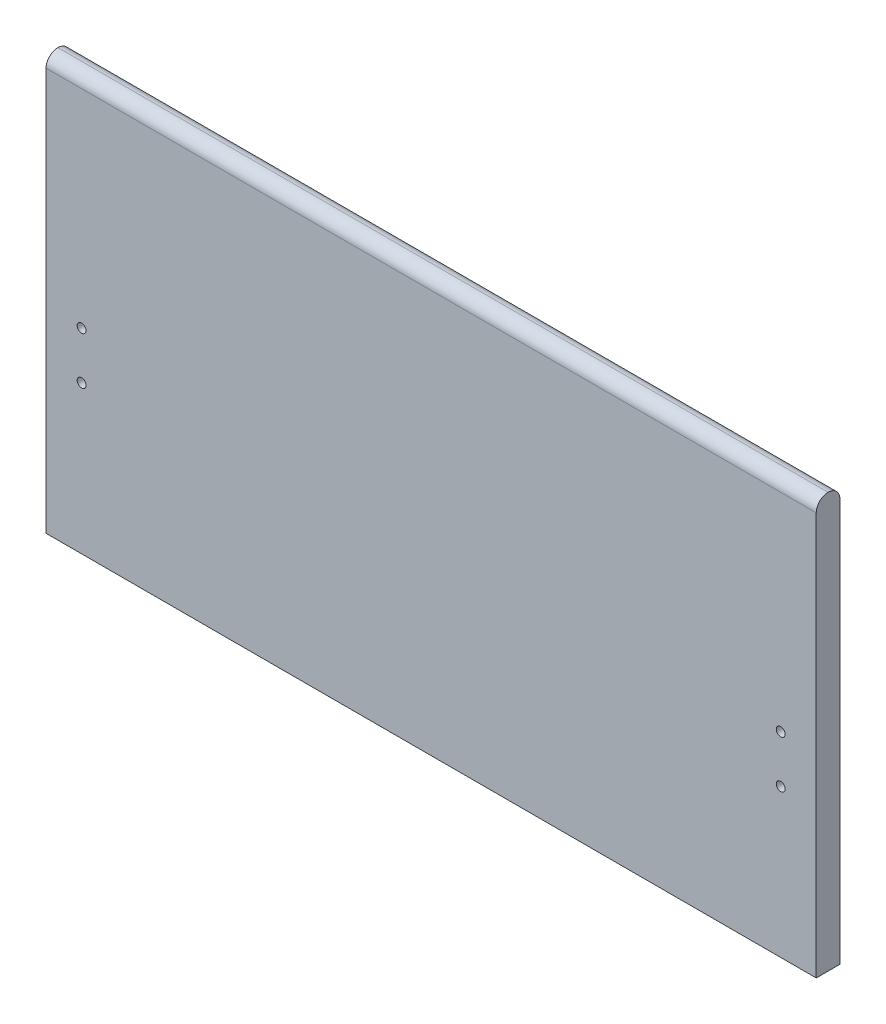
ISO-10303-21;
HEADER;
FILE_DESCRIPTION(('STEP AP214'),'2;1');
FILE_NAME('part.step','',(''),(''),'','','');
FILE_SCHEMA(('AUTOMOTIVE_DESIGN { 1 0 10303 214 1 1 1 1 }'));
ENDSEC;
DATA;
#1=APPLICATION_CONTEXT('core data for automotive mechanical design processes');
#2=APPLICATION_PROTOCOL_DEFINITION('international standard','automotive_design',2000,#1);
#3=PRODUCT_CONTEXT('',#1,'mechanical');
#4=PRODUCT('Part','Part','',(#3));
#5=PRODUCT_RELATED_PRODUCT_CATEGORY('part','',(#4));
#6=PRODUCT_DEFINITION_FORMATION('','',#4);
#7=PRODUCT_DEFINITION_CONTEXT('part definition',#1,'design');
#8=PRODUCT_DEFINITION('design','',#6,#7);
#9=PRODUCT_DEFINITION_SHAPE('','',#8);
#10=(LENGTH_UNIT() NAMED_UNIT(*) SI_UNIT(.MILLI.,.METRE.));
#11=(NAMED_UNIT(*) PLANE_ANGLE_UNIT() SI_UNIT($,.RADIAN.));
#12=(NAMED_UNIT(*) SI_UNIT($,.STERADIAN.) SOLID_ANGLE_UNIT());
#13=UNCERTAINTY_MEASURE_WITH_UNIT(LENGTH_MEASURE(1.E-05),#10,'distance_accuracy_value','');
#14=(GEOMETRIC_REPRESENTATION_CONTEXT(3) GLOBAL_UNCERTAINTY_ASSIGNED_CONTEXT((#13)) GLOBAL_UNIT_ASSIGNED_CONTEXT((#10,
#11,#12)) REPRESENTATION_CONTEXT('',''));
#15=CARTESIAN_POINT('',(0.,0.,0.));
#16=DIRECTION('',(0.,0.,1.));
#17=DIRECTION('',(1.,0.,0.));
#18=AXIS2_PLACEMENT_3D('',#15,#16,#17);
#19=CARTESIAN_POINT('',(0.,0.,40.));
#20=DIRECTION('',(1.,0.,0.));
#21=DIRECTION('',(0.,1.,0.));
#22=AXIS2_PLACEMENT_3D('',#19,#20,#21);
#23=PLANE('',#22);
#24=CARTESIAN_POINT('',(0.,-20.,20.));
#25=DIRECTION('',(1.,0.,0.));
#26=DIRECTION('',(0.,1.,0.));
#27=AXIS2_PLACEMENT_3D('',#24,#25,#26);
#28=CIRCLE('',#27,20.);
#29=CARTESIAN_POINT('',(0.,-20.,40.));
#30=VERTEX_POINT('',#29);
#31=CARTESIAN_POINT('',(0.,0.,20.));
#32=VERTEX_POINT('',#31);
#33=EDGE_CURVE('E99',#30,#32,#28,.F.);
#34=ORIENTED_EDGE('',*,*,#33,.T.);
#35=CARTESIAN_POINT('',(0.,-20.,20.));
#36=DIRECTION('',(1.,0.,0.));
#37=DIRECTION('',(0.,1.,0.));
#38=AXIS2_PLACEMENT_3D('',#35,#36,#37);
#39=CIRCLE('',#38,20.);
#40=CARTESIAN_POINT('',(0.,-20.,0.));
#41=VERTEX_POINT('',#40);
#42=EDGE_CURVE('E101',#32,#41,#39,.F.);
#43=ORIENTED_EDGE('',*,*,#42,.T.);
#44=DIRECTION('',(0.,-1.,0.));
#45=VECTOR('',#44,1.);
#46=CARTESIAN_POINT('',(0.,0.,0.));
#47=LINE('',#46,#45);
#48=CARTESIAN_POINT('',(0.,-700.,0.));
#49=VERTEX_POINT('',#48);
#50=EDGE_CURVE('E97',#41,#49,#47,.T.);
#51=ORIENTED_EDGE('',*,*,#50,.T.);
#52=DIRECTION('',(0.,0.,-1.));
#53=VECTOR('',#52,1.);
#54=CARTESIAN_POINT('',(0.,-700.,40.));
#55=LINE('',#54,#53);
#56=CARTESIAN_POINT('',(0.,-700.,40.));
#57=VERTEX_POINT('',#56);
#58=EDGE_CURVE('E91',#57,#49,#55,.T.);
#59=ORIENTED_EDGE('',*,*,#58,.F.);
#60=DIRECTION('',(0.,-1.,0.));
#61=VECTOR('',#60,1.);
#62=CARTESIAN_POINT('',(0.,0.,40.));
#63=LINE('',#62,#61);
#64=EDGE_CURVE('E77',#30,#57,#63,.T.);
#65=ORIENTED_EDGE('',*,*,#64,.F.);
#66=EDGE_LOOP('',(#34,#43,#51,#59,#65));
#67=FACE_BOUND('',#66,.T.);
#68=ADVANCED_FACE('F33',(#67),#23,.F.);
#69=CARTESIAN_POINT('',(0.,-700.,40.));
#70=DIRECTION('',(0.,1.,0.));
#71=DIRECTION('',(0.,0.,1.));
#72=AXIS2_PLACEMENT_3D('',#69,#70,#71);
#73=PLANE('',#72);
#74=DIRECTION('',(1.,0.,0.));
#75=VECTOR('',#74,1.);
#76=CARTESIAN_POINT('',(0.,-700.,0.));
#77=LINE('',#76,#75);
#78=CARTESIAN_POINT('',(1300.,-700.,0.));
#79=VERTEX_POINT('',#78);
#80=EDGE_CURVE('E118',#49,#79,#77,.T.);
#81=ORIENTED_EDGE('',*,*,#80,.T.);
#82=DIRECTION('',(0.,0.,-1.));
#83=VECTOR('',#82,1.);
#84=CARTESIAN_POINT('',(1300.,-700.,40.));
#85=LINE('',#84,#83);
#86=CARTESIAN_POINT('',(1300.,-700.,40.));
#87=VERTEX_POINT('',#86);
#88=EDGE_CURVE('E93',#87,#79,#85,.T.);
#89=ORIENTED_EDGE('',*,*,#88,.F.);
#90=DIRECTION('',(1.,0.,0.));
#91=VECTOR('',#90,1.);
#92=CARTESIAN_POINT('',(0.,-700.,40.));
#93=LINE('',#92,#91);
#94=EDGE_CURVE('E80',#57,#87,#93,.T.);
#95=ORIENTED_EDGE('',*,*,#94,.F.);
#96=ORIENTED_EDGE('',*,*,#58,.T.);
#97=EDGE_LOOP('',(#81,#89,#95,#96));
#98=FACE_BOUND('',#97,.T.);
#99=ADVANCED_FACE('F90',(#98),#73,.F.);
#100=CARTESIAN_POINT('',(1300.,0.,40.));
#101=DIRECTION('',(-1.,0.,0.));
#102=DIRECTION('',(0.,0.,1.));
#103=AXIS2_PLACEMENT_3D('',#100,#101,#102);
#104=PLANE('',#103);
#105=DIRECTION('',(0.,1.,0.));
#106=VECTOR('',#105,1.);
#107=CARTESIAN_POINT('',(1300.,0.,0.));
#108=LINE('',#107,#106);
#109=CARTESIAN_POINT('',(1300.,-20.,0.));
#110=VERTEX_POINT('',#109);
#111=EDGE_CURVE('E86',#79,#110,#108,.T.);
#112=ORIENTED_EDGE('',*,*,#111,.T.);
#113=CARTESIAN_POINT('',(1300.,-20.,20.));
#114=DIRECTION('',(-1.,0.,0.));
#115=DIRECTION('',(0.,0.,1.));
#116=AXIS2_PLACEMENT_3D('',#113,#114,#115);
#117=CIRCLE('',#116,20.);
#118=CARTESIAN_POINT('',(1300.,0.,20.));
#119=VERTEX_POINT('',#118);
#120=EDGE_CURVE('E42',#110,#119,#117,.F.);
#121=ORIENTED_EDGE('',*,*,#120,.T.);
#122=CARTESIAN_POINT('',(1300.,-20.,20.));
#123=DIRECTION('',(-1.,0.,0.));
#124=DIRECTION('',(0.,0.,1.));
#125=AXIS2_PLACEMENT_3D('',#122,#123,#124);
#126=CIRCLE('',#125,20.);
#127=CARTESIAN_POINT('',(1300.,-20.,40.));
#128=VERTEX_POINT('',#127);
#129=EDGE_CURVE('E49',#119,#128,#126,.F.);
#130=ORIENTED_EDGE('',*,*,#129,.T.);
#131=DIRECTION('',(0.,1.,0.));
#132=VECTOR('',#131,1.);
#133=CARTESIAN_POINT('',(1300.,0.,40.));
#134=LINE('',#133,#132);
#135=EDGE_CURVE('E94',#87,#128,#134,.T.);
#136=ORIENTED_EDGE('',*,*,#135,.F.);
#137=ORIENTED_EDGE('',*,*,#88,.T.);
#138=EDGE_LOOP('',(#112,#121,#130,#136,#137));
#139=FACE_BOUND('',#138,.T.);
#140=ADVANCED_FACE('F117',(#139),#104,.F.);
#141=CARTESIAN_POINT('',(0.,0.,40.));
#142=DIRECTION('',(0.,0.,1.));
#143=DIRECTION('',(1.,0.,0.));
#144=AXIS2_PLACEMENT_3D('',#141,#142,#143);
#145=PLANE('',#144);
#146=CARTESIAN_POINT('',(60.,-450.,40.));
#147=DIRECTION('',(0.,0.,1.));
#148=DIRECTION('',(1.,0.,0.));
#149=AXIS2_PLACEMENT_3D('',#146,#147,#148);
#150=CIRCLE('',#149,7.50000000000002);
#151=CARTESIAN_POINT('',(67.5,-450.,40.));
#152=VERTEX_POINT('',#151);
#153=EDGE_CURVE('E142',#152,#152,#150,.T.);
#154=ORIENTED_EDGE('',*,*,#153,.F.);
#155=EDGE_LOOP('',(#154));
#156=FACE_BOUND('',#155,.T.);
#157=CARTESIAN_POINT('',(1240.,-370.,40.));
#158=DIRECTION('',(0.,0.,1.));
#159=DIRECTION('',(1.,0.,0.));
#160=AXIS2_PLACEMENT_3D('',#157,#158,#159);
#161=CIRCLE('',#160,7.49999999999996);
#162=CARTESIAN_POINT('',(1247.5,-370.,40.));
#163=VERTEX_POINT('',#162);
#164=EDGE_CURVE('E136',#163,#163,#161,.T.);
#165=ORIENTED_EDGE('',*,*,#164,.F.);
#166=EDGE_LOOP('',(#165));
#167=FACE_BOUND('',#166,.T.);
#168=CARTESIAN_POINT('',(1240.,-450.,40.));
#169=DIRECTION('',(0.,0.,1.));
#170=DIRECTION('',(1.,0.,0.));
#171=AXIS2_PLACEMENT_3D('',#168,#169,#170);
#172=CIRCLE('',#171,7.49999999999996);
#173=CARTESIAN_POINT('',(1247.5,-450.,40.));
#174=VERTEX_POINT('',#173);
#175=EDGE_CURVE('E130',#174,#174,#172,.T.);
#176=ORIENTED_EDGE('',*,*,#175,.F.);
#177=EDGE_LOOP('',(#176));
#178=FACE_BOUND('',#177,.T.);
#179=CARTESIAN_POINT('',(60.,-370.,40.));
#180=DIRECTION('',(0.,0.,1.));
#181=DIRECTION('',(1.,0.,0.));
#182=AXIS2_PLACEMENT_3D('',#179,#180,#181);
#183=CIRCLE('',#182,7.50000000000003);
#184=CARTESIAN_POINT('',(67.5,-370.,40.));
#185=VERTEX_POINT('',#184);
#186=EDGE_CURVE('E123',#185,#185,#183,.T.);
#187=ORIENTED_EDGE('',*,*,#186,.F.);
#188=EDGE_LOOP('',(#187));
#189=FACE_BOUND('',#188,.T.);
#190=ORIENTED_EDGE('',*,*,#135,.T.);
#191=DIRECTION('',(-1.,0.,0.));
#192=VECTOR('',#191,1.);
#193=CARTESIAN_POINT('',(0.,-20.,40.));
#194=LINE('',#193,#192);
#195=EDGE_CURVE('E11',#128,#30,#194,.T.);
#196=ORIENTED_EDGE('',*,*,#195,.T.);
#197=ORIENTED_EDGE('',*,*,#64,.T.);
#198=ORIENTED_EDGE('',*,*,#94,.T.);
#199=EDGE_LOOP('',(#190,#196,#197,#198));
#200=FACE_BOUND('',#199,.T.);
#201=ADVANCED_FACE('F79',(#156,#167,#178,#189,#200),#145,.T.);
#202=CARTESIAN_POINT('',(0.,0.,0.));
#203=DIRECTION('',(0.,0.,1.));
#204=DIRECTION('',(1.,0.,0.));
#205=AXIS2_PLACEMENT_3D('',#202,#203,#204);
#206=PLANE('',#205);
#207=ORIENTED_EDGE('',*,*,#50,.F.);
#208=DIRECTION('',(-1.,0.,0.));
#209=VECTOR('',#208,1.);
#210=CARTESIAN_POINT('',(0.,-20.,0.));
#211=LINE('',#210,#209);
#212=EDGE_CURVE('E107',#41,#110,#211,.F.);
#213=ORIENTED_EDGE('',*,*,#212,.T.);
#214=ORIENTED_EDGE('',*,*,#111,.F.);
#215=ORIENTED_EDGE('',*,*,#80,.F.);
#216=EDGE_LOOP('',(#207,#213,#214,#215));
#217=FACE_BOUND('',#216,.T.);
#218=ADVANCED_FACE('F114',(#217),#206,.F.);
#219=CARTESIAN_POINT('',(0.,-20.,20.));
#220=DIRECTION('',(1.,0.,0.));
#221=DIRECTION('',(0.,0.,-1.));
#222=AXIS2_PLACEMENT_3D('',#219,#220,#221);
#223=CYLINDRICAL_SURFACE('',#222,20.);
#224=ORIENTED_EDGE('',*,*,#195,.F.);
#225=ORIENTED_EDGE('',*,*,#129,.F.);
#226=DIRECTION('',(-1.,0.,0.));
#227=VECTOR('',#226,1.);
#228=CARTESIAN_POINT('',(1300.,0.,20.));
#229=LINE('',#228,#227);
#230=EDGE_CURVE('E37',#32,#119,#229,.F.);
#231=ORIENTED_EDGE('',*,*,#230,.F.);
#232=ORIENTED_EDGE('',*,*,#33,.F.);
#233=EDGE_LOOP('',(#224,#225,#231,#232));
#234=FACE_BOUND('',#233,.T.);
#235=ADVANCED_FACE('F35',(#234),#223,.T.);
#236=CARTESIAN_POINT('',(0.,-20.,20.));
#237=DIRECTION('',(-1.,0.,0.));
#238=DIRECTION('',(0.,0.,1.));
#239=AXIS2_PLACEMENT_3D('',#236,#237,#238);
#240=CYLINDRICAL_SURFACE('',#239,20.);
#241=ORIENTED_EDGE('',*,*,#120,.F.);
#242=ORIENTED_EDGE('',*,*,#212,.F.);
#243=ORIENTED_EDGE('',*,*,#42,.F.);
#244=ORIENTED_EDGE('',*,*,#230,.T.);
#245=EDGE_LOOP('',(#241,#242,#243,#244));
#246=FACE_BOUND('',#245,.T.);
#247=ADVANCED_FACE('F169',(#246),#240,.T.);
#248=CARTESIAN_POINT('',(60.,-370.,10.));
#249=DIRECTION('',(0.,0.,1.));
#250=DIRECTION('',(1.,0.,0.));
#251=AXIS2_PLACEMENT_3D('',#248,#249,#250);
#252=CYLINDRICAL_SURFACE('',#251,7.50000000000003);
#253=CARTESIAN_POINT('',(60.,-370.,10.));
#254=DIRECTION('',(0.,0.,1.));
#255=DIRECTION('',(1.,0.,0.));
#256=AXIS2_PLACEMENT_3D('',#253,#254,#255);
#257=CIRCLE('',#256,7.50000000000003);
#258=CARTESIAN_POINT('',(67.5,-370.,10.));
#259=VERTEX_POINT('',#258);
#260=EDGE_CURVE('E126',#259,#259,#257,.T.);
#261=ORIENTED_EDGE('',*,*,#260,.F.);
#262=EDGE_LOOP('',(#261));
#263=FACE_BOUND('',#262,.T.);
#264=ORIENTED_EDGE('',*,*,#186,.T.);
#265=EDGE_LOOP('',(#264));
#266=FACE_BOUND('',#265,.T.);
#267=ADVANCED_FACE('F166',(#263,#266),#252,.F.);
#268=CARTESIAN_POINT('',(60.,-370.,10.));
#269=DIRECTION('',(0.,0.,1.));
#270=DIRECTION('',(1.,0.,0.));
#271=AXIS2_PLACEMENT_3D('',#268,#269,#270);
#272=PLANE('',#271);
#273=ORIENTED_EDGE('',*,*,#260,.T.);
#274=EDGE_LOOP('',(#273));
#275=FACE_BOUND('',#274,.T.);
#276=ADVANCED_FACE('F168',(#275),#272,.T.);
#277=CARTESIAN_POINT('',(1240.,-450.,10.));
#278=DIRECTION('',(0.,0.,1.));
#279=DIRECTION('',(1.,0.,0.));
#280=AXIS2_PLACEMENT_3D('',#277,#278,#279);
#281=CYLINDRICAL_SURFACE('',#280,7.49999999999996);
#282=CARTESIAN_POINT('',(1240.,-450.,10.));
#283=DIRECTION('',(0.,0.,1.));
#284=DIRECTION('',(1.,0.,0.));
#285=AXIS2_PLACEMENT_3D('',#282,#283,#284);
#286=CIRCLE('',#285,7.49999999999996);
#287=CARTESIAN_POINT('',(1247.5,-450.,10.));
#288=VERTEX_POINT('',#287);
#289=EDGE_CURVE('E133',#288,#288,#286,.T.);
#290=ORIENTED_EDGE('',*,*,#289,.F.);
#291=EDGE_LOOP('',(#290));
#292=FACE_BOUND('',#291,.T.);
#293=ORIENTED_EDGE('',*,*,#175,.T.);
#294=EDGE_LOOP('',(#293));
#295=FACE_BOUND('',#294,.T.);
#296=ADVANCED_FACE('F176',(#292,#295),#281,.F.);
#297=CARTESIAN_POINT('',(1240.,-450.,10.));
#298=DIRECTION('',(0.,0.,1.));
#299=DIRECTION('',(1.,0.,0.));
#300=AXIS2_PLACEMENT_3D('',#297,#298,#299);
#301=PLANE('',#300);
#302=ORIENTED_EDGE('',*,*,#289,.T.);
#303=EDGE_LOOP('',(#302));
#304=FACE_BOUND('',#303,.T.);
#305=ADVANCED_FACE('F229',(#304),#301,.T.);
#306=CARTESIAN_POINT('',(1240.,-370.,10.));
#307=DIRECTION('',(0.,0.,1.));
#308=DIRECTION('',(1.,0.,0.));
#309=AXIS2_PLACEMENT_3D('',#306,#307,#308);
#310=CYLINDRICAL_SURFACE('',#309,7.49999999999996);
#311=CARTESIAN_POINT('',(1240.,-370.,10.));
#312=DIRECTION('',(0.,0.,1.));
#313=DIRECTION('',(1.,0.,0.));
#314=AXIS2_PLACEMENT_3D('',#311,#312,#313);
#315=CIRCLE('',#314,7.49999999999996);
#316=CARTESIAN_POINT('',(1247.5,-370.,10.));
#317=VERTEX_POINT('',#316);
#318=EDGE_CURVE('E139',#317,#317,#315,.T.);
#319=ORIENTED_EDGE('',*,*,#318,.F.);
#320=EDGE_LOOP('',(#319));
#321=FACE_BOUND('',#320,.T.);
#322=ORIENTED_EDGE('',*,*,#164,.T.);
#323=EDGE_LOOP('',(#322));
#324=FACE_BOUND('',#323,.T.);
#325=ADVANCED_FACE('F239',(#321,#324),#310,.F.);
#326=CARTESIAN_POINT('',(1240.,-370.,10.));
#327=DIRECTION('',(0.,0.,1.));
#328=DIRECTION('',(1.,0.,0.));
#329=AXIS2_PLACEMENT_3D('',#326,#327,#328);
#330=PLANE('',#329);
#331=ORIENTED_EDGE('',*,*,#318,.T.);
#332=EDGE_LOOP('',(#331));
#333=FACE_BOUND('',#332,.T.);
#334=ADVANCED_FACE('F153',(#333),#330,.T.);
#335=CARTESIAN_POINT('',(60.,-450.,10.));
#336=DIRECTION('',(0.,0.,1.));
#337=DIRECTION('',(1.,0.,0.));
#338=AXIS2_PLACEMENT_3D('',#335,#336,#337);
#339=CYLINDRICAL_SURFACE('',#338,7.50000000000002);
#340=CARTESIAN_POINT('',(60.,-450.,10.));
#341=DIRECTION('',(0.,0.,1.));
#342=DIRECTION('',(1.,0.,0.));
#343=AXIS2_PLACEMENT_3D('',#340,#341,#342);
#344=CIRCLE('',#343,7.50000000000002);
#345=CARTESIAN_POINT('',(67.5,-450.,10.));
#346=VERTEX_POINT('',#345);
#347=EDGE_CURVE('E127',#346,#346,#344,.T.);
#348=ORIENTED_EDGE('',*,*,#347,.F.);
#349=EDGE_LOOP('',(#348));
#350=FACE_BOUND('',#349,.T.);
#351=ORIENTED_EDGE('',*,*,#153,.T.);
#352=EDGE_LOOP('',(#351));
#353=FACE_BOUND('',#352,.T.);
#354=ADVANCED_FACE('F150',(#350,#353),#339,.F.);
#355=CARTESIAN_POINT('',(60.,-450.,10.));
#356=DIRECTION('',(0.,0.,1.));
#357=DIRECTION('',(1.,0.,0.));
#358=AXIS2_PLACEMENT_3D('',#355,#356,#357);
#359=PLANE('',#358);
#360=ORIENTED_EDGE('',*,*,#347,.T.);
#361=EDGE_LOOP('',(#360));
#362=FACE_BOUND('',#361,.T.);
#363=ADVANCED_FACE('F148',(#362),#359,.T.);
#364=CLOSED_SHELL('',(#68,#99,#140,#201,#218,#235,#247,#267,#276,#296,#305,#325,#334,#354,#363));
#365=MANIFOLD_SOLID_BREP('B2',#364);
#366=ADVANCED_BREP_SHAPE_REPRESENTATION('',(#18,#365),#14);
#367=SHAPE_DEFINITION_REPRESENTATION(#9,#366);
ENDSEC;
END-ISO-10303-21;
